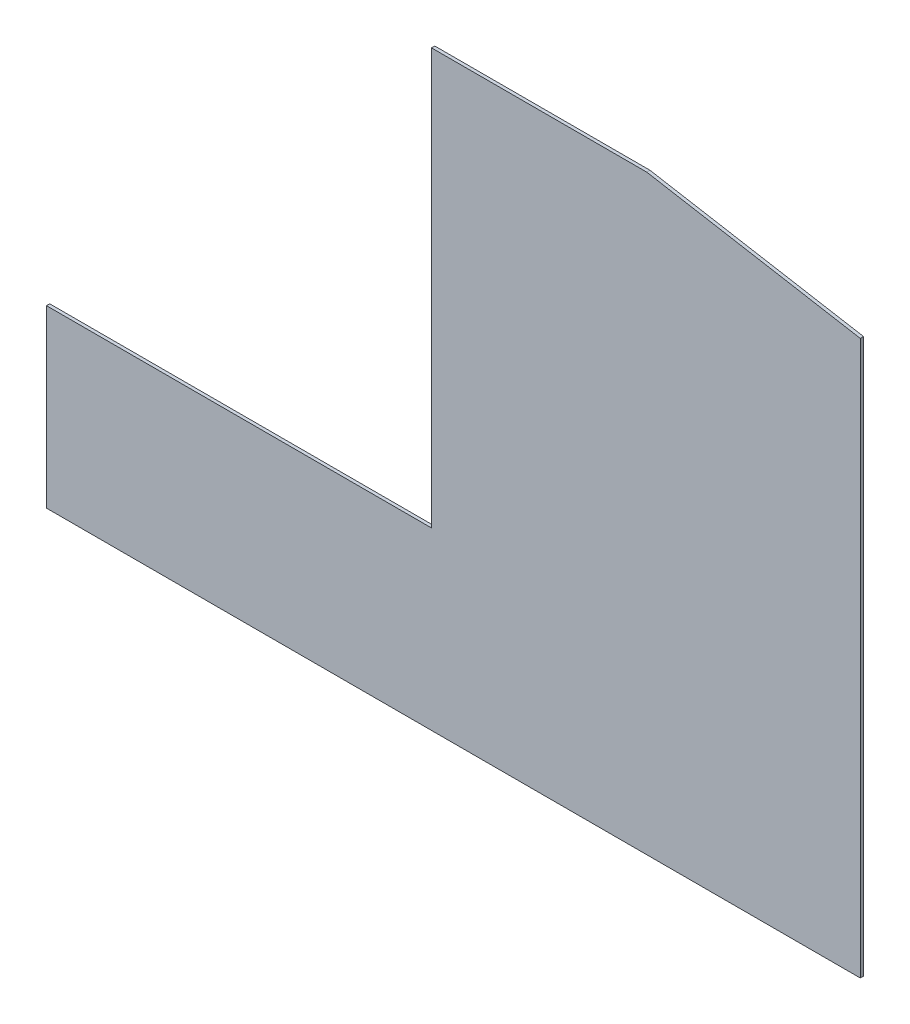
ISO-10303-21;
HEADER;
FILE_DESCRIPTION(('STEP AP214'),'2;1');
FILE_NAME('part.step','',(''),(''),'','','');
FILE_SCHEMA(('AUTOMOTIVE_DESIGN { 1 0 10303 214 1 1 1 1 }'));
ENDSEC;
DATA;
#1=APPLICATION_CONTEXT('core data for automotive mechanical design processes');
#2=APPLICATION_PROTOCOL_DEFINITION('international standard','automotive_design',2000,#1);
#3=PRODUCT_CONTEXT('',#1,'mechanical');
#4=PRODUCT('Part','Part','',(#3));
#5=PRODUCT_RELATED_PRODUCT_CATEGORY('part','',(#4));
#6=PRODUCT_DEFINITION_FORMATION('','',#4);
#7=PRODUCT_DEFINITION_CONTEXT('part definition',#1,'design');
#8=PRODUCT_DEFINITION('design','',#6,#7);
#9=PRODUCT_DEFINITION_SHAPE('','',#8);
#10=(LENGTH_UNIT() NAMED_UNIT(*) SI_UNIT(.MILLI.,.METRE.));
#11=(NAMED_UNIT(*) PLANE_ANGLE_UNIT() SI_UNIT($,.RADIAN.));
#12=(NAMED_UNIT(*) SI_UNIT($,.STERADIAN.) SOLID_ANGLE_UNIT());
#13=UNCERTAINTY_MEASURE_WITH_UNIT(LENGTH_MEASURE(1.E-05),#10,'distance_accuracy_value','');
#14=(GEOMETRIC_REPRESENTATION_CONTEXT(3) GLOBAL_UNCERTAINTY_ASSIGNED_CONTEXT((#13)) GLOBAL_UNIT_ASSIGNED_CONTEXT((#10,
#11,#12)) REPRESENTATION_CONTEXT('',''));
#15=CARTESIAN_POINT('',(0.,0.,0.));
#16=DIRECTION('',(0.,0.,1.));
#17=DIRECTION('',(1.,0.,0.));
#18=AXIS2_PLACEMENT_3D('',#15,#16,#17);
#19=CARTESIAN_POINT('',(0.,0.,-10.));
#20=DIRECTION('',(-1.,0.,0.));
#21=DIRECTION('',(0.,0.,1.));
#22=AXIS2_PLACEMENT_3D('',#19,#20,#21);
#23=PLANE('',#22);
#24=DIRECTION('',(0.,0.,1.));
#25=VECTOR('',#24,1.);
#26=CARTESIAN_POINT('',(0.,550.,-10.));
#27=LINE('',#26,#25);
#28=CARTESIAN_POINT('',(0.,550.,-10.));
#29=VERTEX_POINT('',#28);
#30=CARTESIAN_POINT('',(0.,550.,0.));
#31=VERTEX_POINT('',#30);
#32=EDGE_CURVE('E55',#29,#31,#27,.T.);
#33=ORIENTED_EDGE('',*,*,#32,.F.);
#34=DIRECTION('',(0.,-1.,0.));
#35=VECTOR('',#34,1.);
#36=CARTESIAN_POINT('',(0.,0.,-10.));
#37=LINE('',#36,#35);
#38=CARTESIAN_POINT('',(0.,7.99999999999986,-10.));
#39=VERTEX_POINT('',#38);
#40=EDGE_CURVE('E122',#29,#39,#37,.T.);
#41=ORIENTED_EDGE('',*,*,#40,.T.);
#42=DIRECTION('',(0.,0.,1.));
#43=VECTOR('',#42,1.);
#44=CARTESIAN_POINT('',(0.,7.99999999999986,-10.));
#45=LINE('',#44,#43);
#46=CARTESIAN_POINT('',(0.,7.99999999999986,0.));
#47=VERTEX_POINT('',#46);
#48=EDGE_CURVE('E118',#39,#47,#45,.T.);
#49=ORIENTED_EDGE('',*,*,#48,.T.);
#50=DIRECTION('',(0.,-1.,0.));
#51=VECTOR('',#50,1.);
#52=CARTESIAN_POINT('',(0.,0.,0.));
#53=LINE('',#52,#51);
#54=EDGE_CURVE('E140',#31,#47,#53,.T.);
#55=ORIENTED_EDGE('',*,*,#54,.F.);
#56=EDGE_LOOP('',(#33,#41,#49,#55));
#57=FACE_BOUND('',#56,.T.);
#58=ADVANCED_FACE('F40',(#57),#23,.T.);
#59=CARTESIAN_POINT('',(660.,1834.99999999999,-10.));
#60=DIRECTION('',(0.,1.,0.));
#61=DIRECTION('',(-1.,0.,0.));
#62=AXIS2_PLACEMENT_3D('',#59,#60,#61);
#63=PLANE('',#62);
#64=DIRECTION('',(0.,0.,1.));
#65=VECTOR('',#64,1.);
#66=CARTESIAN_POINT('',(1190.,1835.,-10.));
#67=LINE('',#66,#65);
#68=CARTESIAN_POINT('',(1190.,1835.,-10.));
#69=VERTEX_POINT('',#68);
#70=CARTESIAN_POINT('',(1190.,1835.,0.));
#71=VERTEX_POINT('',#70);
#72=EDGE_CURVE('E99',#69,#71,#67,.T.);
#73=ORIENTED_EDGE('',*,*,#72,.T.);
#74=DIRECTION('',(-1.,0.,0.));
#75=VECTOR('',#74,1.);
#76=CARTESIAN_POINT('',(660.,1834.99999999999,0.));
#77=LINE('',#76,#75);
#78=CARTESIAN_POINT('',(1855.,1835.,0.));
#79=VERTEX_POINT('',#78);
#80=EDGE_CURVE('E138',#79,#71,#77,.T.);
#81=ORIENTED_EDGE('',*,*,#80,.F.);
#82=DIRECTION('',(0.,0.,1.));
#83=VECTOR('',#82,1.);
#84=CARTESIAN_POINT('',(1855.,1835.,-10.));
#85=LINE('',#84,#83);
#86=CARTESIAN_POINT('',(1855.,1835.,-10.));
#87=VERTEX_POINT('',#86);
#88=EDGE_CURVE('E121',#87,#79,#85,.T.);
#89=ORIENTED_EDGE('',*,*,#88,.F.);
#90=DIRECTION('',(-1.,0.,0.));
#91=VECTOR('',#90,1.);
#92=CARTESIAN_POINT('',(660.,1834.99999999999,-10.));
#93=LINE('',#92,#91);
#94=EDGE_CURVE('E115',#87,#69,#93,.T.);
#95=ORIENTED_EDGE('',*,*,#94,.T.);
#96=EDGE_LOOP('',(#73,#81,#89,#95));
#97=FACE_BOUND('',#96,.T.);
#98=ADVANCED_FACE('F120',(#97),#63,.T.);
#99=CARTESIAN_POINT('',(1855.,1835.,-10.));
#100=DIRECTION('',(0.171656131374064,0.985156927885954,0.));
#101=DIRECTION('',(-0.985156927885954,0.171656131374064,0.));
#102=AXIS2_PLACEMENT_3D('',#99,#100,#101);
#103=PLANE('',#102);
#104=DIRECTION('',(-0.985156927885954,0.171656131374064,0.));
#105=VECTOR('',#104,1.);
#106=CARTESIAN_POINT('',(1855.,1835.,0.));
#107=LINE('',#106,#105);
#108=CARTESIAN_POINT('',(2515.,1720.,0.));
#109=VERTEX_POINT('',#108);
#110=EDGE_CURVE('E134',#109,#79,#107,.T.);
#111=ORIENTED_EDGE('',*,*,#110,.F.);
#112=DIRECTION('',(0.,0.,1.));
#113=VECTOR('',#112,1.);
#114=CARTESIAN_POINT('',(2515.,1720.,-10.));
#115=LINE('',#114,#113);
#116=CARTESIAN_POINT('',(2515.,1720.,-10.));
#117=VERTEX_POINT('',#116);
#118=EDGE_CURVE('E126',#117,#109,#115,.T.);
#119=ORIENTED_EDGE('',*,*,#118,.F.);
#120=DIRECTION('',(-0.985156927885954,0.171656131374064,0.));
#121=VECTOR('',#120,1.);
#122=CARTESIAN_POINT('',(1855.,1835.,-10.));
#123=LINE('',#122,#121);
#124=EDGE_CURVE('E123',#117,#87,#123,.T.);
#125=ORIENTED_EDGE('',*,*,#124,.T.);
#126=ORIENTED_EDGE('',*,*,#88,.T.);
#127=EDGE_LOOP('',(#111,#119,#125,#126));
#128=FACE_BOUND('',#127,.T.);
#129=ADVANCED_FACE('F163',(#128),#103,.T.);
#130=CARTESIAN_POINT('',(2515.,1720.,-10.));
#131=DIRECTION('',(1.,0.,0.));
#132=DIRECTION('',(0.,0.,-1.));
#133=AXIS2_PLACEMENT_3D('',#130,#131,#132);
#134=PLANE('',#133);
#135=DIRECTION('',(0.,0.,1.));
#136=VECTOR('',#135,1.);
#137=CARTESIAN_POINT('',(2515.,7.99999999999986,-10.));
#138=LINE('',#137,#136);
#139=CARTESIAN_POINT('',(2515.,7.99999999999986,-10.));
#140=VERTEX_POINT('',#139);
#141=CARTESIAN_POINT('',(2515.,7.99999999999979,0.));
#142=VERTEX_POINT('',#141);
#143=EDGE_CURVE('E63',#140,#142,#138,.T.);
#144=ORIENTED_EDGE('',*,*,#143,.F.);
#145=DIRECTION('',(0.,1.,0.));
#146=VECTOR('',#145,1.);
#147=CARTESIAN_POINT('',(2515.,1720.,-10.));
#148=LINE('',#147,#146);
#149=EDGE_CURVE('E128',#140,#117,#148,.T.);
#150=ORIENTED_EDGE('',*,*,#149,.T.);
#151=ORIENTED_EDGE('',*,*,#118,.T.);
#152=DIRECTION('',(0.,1.,0.));
#153=VECTOR('',#152,1.);
#154=CARTESIAN_POINT('',(2515.,1720.,0.));
#155=LINE('',#154,#153);
#156=EDGE_CURVE('E132',#142,#109,#155,.T.);
#157=ORIENTED_EDGE('',*,*,#156,.F.);
#158=EDGE_LOOP('',(#144,#150,#151,#157));
#159=FACE_BOUND('',#158,.T.);
#160=ADVANCED_FACE('F42',(#159),#134,.T.);
#161=CARTESIAN_POINT('',(0.,0.,-10.));
#162=DIRECTION('',(0.,0.,-1.));
#163=DIRECTION('',(-1.,0.,0.));
#164=AXIS2_PLACEMENT_3D('',#161,#162,#163);
#165=PLANE('',#164);
#166=DIRECTION('',(0.,1.,0.));
#167=VECTOR('',#166,1.);
#168=CARTESIAN_POINT('',(1190.,1835.,-10.));
#169=LINE('',#168,#167);
#170=CARTESIAN_POINT('',(1190.,550.,-10.));
#171=VERTEX_POINT('',#170);
#172=EDGE_CURVE('E103',#171,#69,#169,.T.);
#173=ORIENTED_EDGE('',*,*,#172,.T.);
#174=ORIENTED_EDGE('',*,*,#94,.F.);
#175=ORIENTED_EDGE('',*,*,#124,.F.);
#176=ORIENTED_EDGE('',*,*,#149,.F.);
#177=DIRECTION('',(-1.,0.,0.));
#178=VECTOR('',#177,1.);
#179=CARTESIAN_POINT('',(0.,7.99999999999986,-10.));
#180=LINE('',#179,#178);
#181=EDGE_CURVE('E154',#140,#39,#180,.T.);
#182=ORIENTED_EDGE('',*,*,#181,.T.);
#183=ORIENTED_EDGE('',*,*,#40,.F.);
#184=DIRECTION('',(1.,0.,0.));
#185=VECTOR('',#184,1.);
#186=CARTESIAN_POINT('',(1190.,550.,-10.));
#187=LINE('',#186,#185);
#188=EDGE_CURVE('E109',#29,#171,#187,.T.);
#189=ORIENTED_EDGE('',*,*,#188,.T.);
#190=EDGE_LOOP('',(#173,#174,#175,#176,#182,#183,#189));
#191=FACE_BOUND('',#190,.T.);
#192=ADVANCED_FACE('F113',(#191),#165,.T.);
#193=CARTESIAN_POINT('',(0.,0.,0.));
#194=DIRECTION('',(0.,0.,-1.));
#195=DIRECTION('',(-1.,0.,0.));
#196=AXIS2_PLACEMENT_3D('',#193,#194,#195);
#197=PLANE('',#196);
#198=ORIENTED_EDGE('',*,*,#80,.T.);
#199=DIRECTION('',(0.,-1.,0.));
#200=VECTOR('',#199,1.);
#201=CARTESIAN_POINT('',(1190.,2.05628855922792E-13,0.));
#202=LINE('',#201,#200);
#203=CARTESIAN_POINT('',(1190.,550.,0.));
#204=VERTEX_POINT('',#203);
#205=EDGE_CURVE('E11',#71,#204,#202,.T.);
#206=ORIENTED_EDGE('',*,*,#205,.T.);
#207=DIRECTION('',(-1.,0.,0.));
#208=VECTOR('',#207,1.);
#209=CARTESIAN_POINT('',(-1.0262565773846E-13,550.,0.));
#210=LINE('',#209,#208);
#211=EDGE_CURVE('E48',#204,#31,#210,.T.);
#212=ORIENTED_EDGE('',*,*,#211,.T.);
#213=ORIENTED_EDGE('',*,*,#54,.T.);
#214=DIRECTION('',(1.,0.,0.));
#215=VECTOR('',#214,1.);
#216=CARTESIAN_POINT('',(0.,7.99999999999986,0.));
#217=LINE('',#216,#215);
#218=EDGE_CURVE('E144',#47,#142,#217,.T.);
#219=ORIENTED_EDGE('',*,*,#218,.T.);
#220=ORIENTED_EDGE('',*,*,#156,.T.);
#221=ORIENTED_EDGE('',*,*,#110,.T.);
#222=EDGE_LOOP('',(#198,#206,#212,#213,#219,#220,#221));
#223=FACE_BOUND('',#222,.T.);
#224=ADVANCED_FACE('F149',(#223),#197,.F.);
#225=CARTESIAN_POINT('',(0.,7.99999999999986,-10.));
#226=DIRECTION('',(0.,1.,0.));
#227=DIRECTION('',(0.,0.,1.));
#228=AXIS2_PLACEMENT_3D('',#225,#226,#227);
#229=PLANE('',#228);
#230=ORIENTED_EDGE('',*,*,#48,.F.);
#231=ORIENTED_EDGE('',*,*,#181,.F.);
#232=ORIENTED_EDGE('',*,*,#143,.T.);
#233=ORIENTED_EDGE('',*,*,#218,.F.);
#234=EDGE_LOOP('',(#230,#231,#232,#233));
#235=FACE_BOUND('',#234,.T.);
#236=ADVANCED_FACE('F164',(#235),#229,.F.);
#237=CARTESIAN_POINT('',(1190.,1835.,-10.));
#238=DIRECTION('',(1.,0.,0.));
#239=DIRECTION('',(0.,1.,0.));
#240=AXIS2_PLACEMENT_3D('',#237,#238,#239);
#241=PLANE('',#240);
#242=ORIENTED_EDGE('',*,*,#72,.F.);
#243=ORIENTED_EDGE('',*,*,#172,.F.);
#244=DIRECTION('',(0.,0.,1.));
#245=VECTOR('',#244,1.);
#246=CARTESIAN_POINT('',(1190.,550.,-10.));
#247=LINE('',#246,#245);
#248=EDGE_CURVE('E135',#171,#204,#247,.T.);
#249=ORIENTED_EDGE('',*,*,#248,.T.);
#250=ORIENTED_EDGE('',*,*,#205,.F.);
#251=EDGE_LOOP('',(#242,#243,#249,#250));
#252=FACE_BOUND('',#251,.T.);
#253=ADVANCED_FACE('F101',(#252),#241,.F.);
#254=CARTESIAN_POINT('',(1190.,550.,-10.));
#255=DIRECTION('',(0.,-1.,0.));
#256=DIRECTION('',(1.,0.,0.));
#257=AXIS2_PLACEMENT_3D('',#254,#255,#256);
#258=PLANE('',#257);
#259=ORIENTED_EDGE('',*,*,#248,.F.);
#260=ORIENTED_EDGE('',*,*,#188,.F.);
#261=ORIENTED_EDGE('',*,*,#32,.T.);
#262=ORIENTED_EDGE('',*,*,#211,.F.);
#263=EDGE_LOOP('',(#259,#260,#261,#262));
#264=FACE_BOUND('',#263,.T.);
#265=ADVANCED_FACE('F171',(#264),#258,.F.);
#266=CLOSED_SHELL('',(#58,#98,#129,#160,#192,#224,#236,#253,#265));
#267=MANIFOLD_SOLID_BREP('B2',#266);
#268=ADVANCED_BREP_SHAPE_REPRESENTATION('',(#18,#267),#14);
#269=SHAPE_DEFINITION_REPRESENTATION(#9,#268);
ENDSEC;
END-ISO-10303-21;
